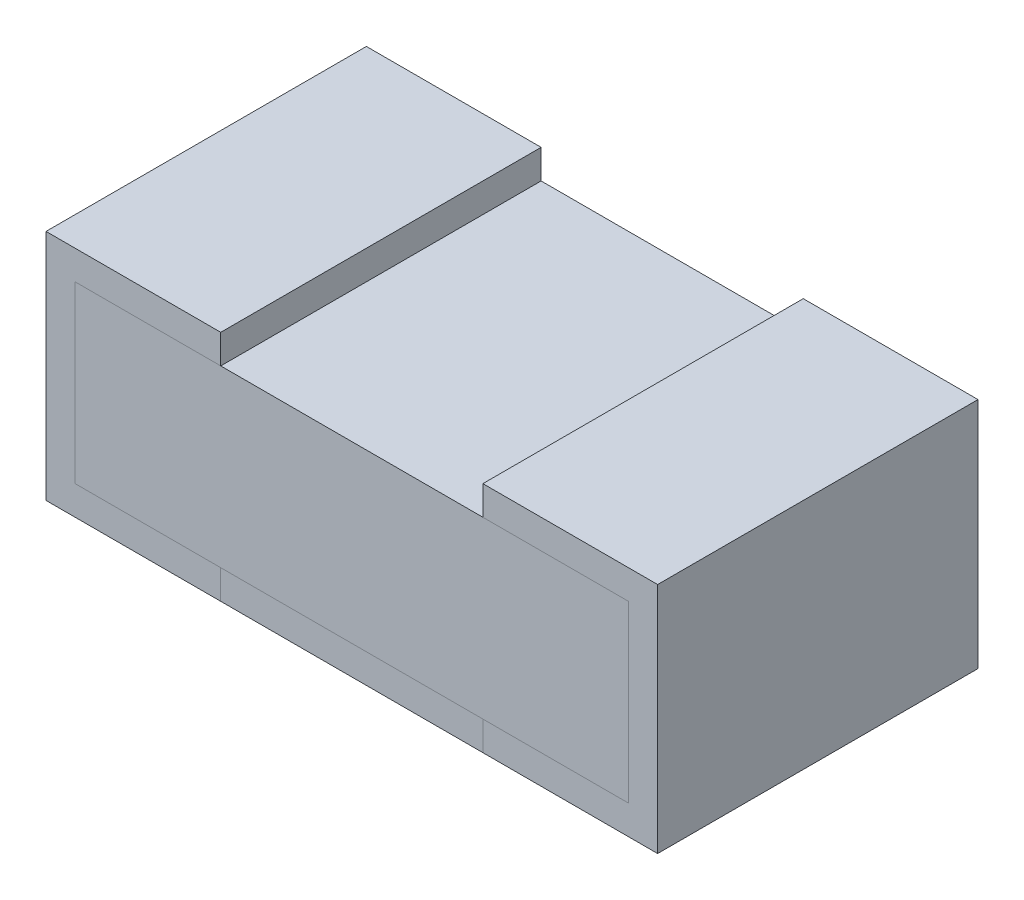
ISO-10303-21;
HEADER;
FILE_DESCRIPTION(('STEP AP214'),'2;1');
FILE_NAME('part.step','',(''),(''),'','','');
FILE_SCHEMA(('AUTOMOTIVE_DESIGN { 1 0 10303 214 1 1 1 1 }'));
ENDSEC;
DATA;
#1=APPLICATION_CONTEXT('core data for automotive mechanical design processes');
#2=APPLICATION_PROTOCOL_DEFINITION('international standard','automotive_design',2000,#1);
#3=PRODUCT_CONTEXT('',#1,'mechanical');
#4=PRODUCT('Part','Part','',(#3));
#5=PRODUCT_RELATED_PRODUCT_CATEGORY('part','',(#4));
#6=PRODUCT_DEFINITION_FORMATION('','',#4);
#7=PRODUCT_DEFINITION_CONTEXT('part definition',#1,'design');
#8=PRODUCT_DEFINITION('design','',#6,#7);
#9=PRODUCT_DEFINITION_SHAPE('','',#8);
#10=(LENGTH_UNIT() NAMED_UNIT(*) SI_UNIT(.MILLI.,.METRE.));
#11=(NAMED_UNIT(*) PLANE_ANGLE_UNIT() SI_UNIT($,.RADIAN.));
#12=(NAMED_UNIT(*) SI_UNIT($,.STERADIAN.) SOLID_ANGLE_UNIT());
#13=UNCERTAINTY_MEASURE_WITH_UNIT(LENGTH_MEASURE(1.E-05),#10,'distance_accuracy_value','');
#14=(GEOMETRIC_REPRESENTATION_CONTEXT(3) GLOBAL_UNCERTAINTY_ASSIGNED_CONTEXT((#13)) GLOBAL_UNIT_ASSIGNED_CONTEXT((#10,
#11,#12)) REPRESENTATION_CONTEXT('',''));
#15=CARTESIAN_POINT('',(0.,0.,0.));
#16=DIRECTION('',(0.,0.,1.));
#17=DIRECTION('',(1.,0.,0.));
#18=AXIS2_PLACEMENT_3D('',#15,#16,#17);
#19=CARTESIAN_POINT('',(0.749999999953739,0.,1.375));
#20=DIRECTION('',(-1.,0.,0.));
#21=DIRECTION('',(0.,0.,1.));
#22=AXIS2_PLACEMENT_3D('',#19,#20,#21);
#23=PLANE('',#22);
#24=DIRECTION('',(0.,1.,0.));
#25=VECTOR('',#24,1.);
#26=CARTESIAN_POINT('',(0.749999999953739,0.,0.));
#27=LINE('',#26,#25);
#28=CARTESIAN_POINT('',(0.749999999953739,0.,0.));
#29=VERTEX_POINT('',#28);
#30=CARTESIAN_POINT('',(0.749999999953739,0.124999999968622,0.));
#31=VERTEX_POINT('',#30);
#32=EDGE_CURVE('E143',#29,#31,#27,.T.);
#33=ORIENTED_EDGE('',*,*,#32,.T.);
#34=DIRECTION('',(0.,0.,-1.));
#35=VECTOR('',#34,1.);
#36=CARTESIAN_POINT('',(0.749999999953739,0.124999999968622,1.375));
#37=LINE('',#36,#35);
#38=CARTESIAN_POINT('',(0.749999999953739,0.124999999968622,1.375));
#39=VERTEX_POINT('',#38);
#40=EDGE_CURVE('E12',#39,#31,#37,.T.);
#41=ORIENTED_EDGE('',*,*,#40,.F.);
#42=DIRECTION('',(0.,1.,0.));
#43=VECTOR('',#42,1.);
#44=CARTESIAN_POINT('',(0.749999999953739,0.,1.375));
#45=LINE('',#44,#43);
#46=CARTESIAN_POINT('',(0.749999999953739,0.,1.375));
#47=VERTEX_POINT('',#46);
#48=EDGE_CURVE('E157',#47,#39,#45,.T.);
#49=ORIENTED_EDGE('',*,*,#48,.F.);
#50=DIRECTION('',(0.,0.,-1.));
#51=VECTOR('',#50,1.);
#52=CARTESIAN_POINT('',(0.749999999953739,0.,1.375));
#53=LINE('',#52,#51);
#54=EDGE_CURVE('E139',#47,#29,#53,.T.);
#55=ORIENTED_EDGE('',*,*,#54,.T.);
#56=EDGE_LOOP('',(#33,#41,#49,#55));
#57=FACE_BOUND('',#56,.T.);
#58=ADVANCED_FACE('F47',(#57),#23,.F.);
#59=CARTESIAN_POINT('',(0.749999999953739,0.124999999968622,1.375));
#60=DIRECTION('',(0.,-1.,0.));
#61=DIRECTION('',(0.,0.,-1.));
#62=AXIS2_PLACEMENT_3D('',#59,#60,#61);
#63=PLANE('',#62);
#64=DIRECTION('',(-1.,0.,0.));
#65=VECTOR('',#64,1.);
#66=CARTESIAN_POINT('',(0.749999999953739,0.124999999968622,0.));
#67=LINE('',#66,#65);
#68=CARTESIAN_POINT('',(0.124999999968484,0.124999999968622,0.));
#69=VERTEX_POINT('',#68);
#70=EDGE_CURVE('E146',#31,#69,#67,.T.);
#71=ORIENTED_EDGE('',*,*,#70,.T.);
#72=DIRECTION('',(0.,0.,-1.));
#73=VECTOR('',#72,1.);
#74=CARTESIAN_POINT('',(0.124999999968484,0.124999999968622,1.375));
#75=LINE('',#74,#73);
#76=CARTESIAN_POINT('',(0.124999999968484,0.124999999968622,1.375));
#77=VERTEX_POINT('',#76);
#78=EDGE_CURVE('E55',#77,#69,#75,.T.);
#79=ORIENTED_EDGE('',*,*,#78,.F.);
#80=DIRECTION('',(-1.,0.,0.));
#81=VECTOR('',#80,1.);
#82=CARTESIAN_POINT('',(0.749999999953739,0.124999999968622,1.375));
#83=LINE('',#82,#81);
#84=EDGE_CURVE('E106',#39,#77,#83,.T.);
#85=ORIENTED_EDGE('',*,*,#84,.F.);
#86=ORIENTED_EDGE('',*,*,#40,.T.);
#87=EDGE_LOOP('',(#71,#79,#85,#86));
#88=FACE_BOUND('',#87,.T.);
#89=ADVANCED_FACE('F192',(#88),#63,.F.);
#90=CARTESIAN_POINT('',(0.124999999968484,0.124999999968622,1.375));
#91=DIRECTION('',(-1.,0.,0.));
#92=DIRECTION('',(0.,0.,1.));
#93=AXIS2_PLACEMENT_3D('',#90,#91,#92);
#94=PLANE('',#93);
#95=DIRECTION('',(0.,1.,0.));
#96=VECTOR('',#95,1.);
#97=CARTESIAN_POINT('',(0.124999999968484,0.124999999968622,0.));
#98=LINE('',#97,#96);
#99=CARTESIAN_POINT('',(0.124999999968484,0.875000000098263,0.));
#100=VERTEX_POINT('',#99);
#101=EDGE_CURVE('E148',#69,#100,#98,.T.);
#102=ORIENTED_EDGE('',*,*,#101,.T.);
#103=DIRECTION('',(0.,0.,-1.));
#104=VECTOR('',#103,1.);
#105=CARTESIAN_POINT('',(0.124999999968484,0.875000000098263,1.375));
#106=LINE('',#105,#104);
#107=CARTESIAN_POINT('',(0.124999999968484,0.875000000098263,1.375));
#108=VERTEX_POINT('',#107);
#109=EDGE_CURVE('E164',#108,#100,#106,.T.);
#110=ORIENTED_EDGE('',*,*,#109,.F.);
#111=DIRECTION('',(0.,1.,0.));
#112=VECTOR('',#111,1.);
#113=CARTESIAN_POINT('',(0.124999999968484,0.124999999968622,1.375));
#114=LINE('',#113,#112);
#115=EDGE_CURVE('E172',#77,#108,#114,.T.);
#116=ORIENTED_EDGE('',*,*,#115,.F.);
#117=ORIENTED_EDGE('',*,*,#78,.T.);
#118=EDGE_LOOP('',(#102,#110,#116,#117));
#119=FACE_BOUND('',#118,.T.);
#120=ADVANCED_FACE('F170',(#119),#94,.F.);
#121=CARTESIAN_POINT('',(0.124999999968484,0.875000000098263,1.375));
#122=DIRECTION('',(0.,1.,0.));
#123=DIRECTION('',(0.,0.,1.));
#124=AXIS2_PLACEMENT_3D('',#121,#122,#123);
#125=PLANE('',#124);
#126=DIRECTION('',(1.,0.,0.));
#127=VECTOR('',#126,1.);
#128=CARTESIAN_POINT('',(0.124999999968484,0.875000000098263,0.));
#129=LINE('',#128,#127);
#130=CARTESIAN_POINT('',(0.749999999953739,0.875000000098263,0.));
#131=VERTEX_POINT('',#130);
#132=EDGE_CURVE('E150',#100,#131,#129,.T.);
#133=ORIENTED_EDGE('',*,*,#132,.T.);
#134=DIRECTION('',(0.,0.,-1.));
#135=VECTOR('',#134,1.);
#136=CARTESIAN_POINT('',(0.749999999953739,0.875000000098263,1.375));
#137=LINE('',#136,#135);
#138=CARTESIAN_POINT('',(0.749999999953739,0.875000000098263,1.375));
#139=VERTEX_POINT('',#138);
#140=EDGE_CURVE('E161',#139,#131,#137,.T.);
#141=ORIENTED_EDGE('',*,*,#140,.F.);
#142=DIRECTION('',(1.,0.,0.));
#143=VECTOR('',#142,1.);
#144=CARTESIAN_POINT('',(0.124999999968484,0.875000000098263,1.375));
#145=LINE('',#144,#143);
#146=EDGE_CURVE('E184',#108,#139,#145,.T.);
#147=ORIENTED_EDGE('',*,*,#146,.F.);
#148=ORIENTED_EDGE('',*,*,#109,.T.);
#149=EDGE_LOOP('',(#133,#141,#147,#148));
#150=FACE_BOUND('',#149,.T.);
#151=ADVANCED_FACE('F180',(#150),#125,.F.);
#152=CARTESIAN_POINT('',(0.749999999953739,0.875000000098263,1.375));
#153=DIRECTION('',(-1.,0.,0.));
#154=DIRECTION('',(0.,0.,1.));
#155=AXIS2_PLACEMENT_3D('',#152,#153,#154);
#156=PLANE('',#155);
#157=DIRECTION('',(0.,1.,0.));
#158=VECTOR('',#157,1.);
#159=CARTESIAN_POINT('',(0.749999999953739,0.875000000098263,0.));
#160=LINE('',#159,#158);
#161=CARTESIAN_POINT('',(0.749999999953739,1.0000000000332,0.));
#162=VERTEX_POINT('',#161);
#163=EDGE_CURVE('E152',#131,#162,#160,.T.);
#164=ORIENTED_EDGE('',*,*,#163,.T.);
#165=DIRECTION('',(0.,0.,-1.));
#166=VECTOR('',#165,1.);
#167=CARTESIAN_POINT('',(0.749999999953739,1.0000000000332,1.375));
#168=LINE('',#167,#166);
#169=CARTESIAN_POINT('',(0.749999999953739,1.0000000000332,1.375));
#170=VERTEX_POINT('',#169);
#171=EDGE_CURVE('E134',#170,#162,#168,.T.);
#172=ORIENTED_EDGE('',*,*,#171,.F.);
#173=DIRECTION('',(0.,1.,0.));
#174=VECTOR('',#173,1.);
#175=CARTESIAN_POINT('',(0.749999999953739,0.875000000098263,1.375));
#176=LINE('',#175,#174);
#177=EDGE_CURVE('E125',#139,#170,#176,.T.);
#178=ORIENTED_EDGE('',*,*,#177,.F.);
#179=ORIENTED_EDGE('',*,*,#140,.T.);
#180=EDGE_LOOP('',(#164,#172,#178,#179));
#181=FACE_BOUND('',#180,.T.);
#182=ADVANCED_FACE('F183',(#181),#156,.F.);
#183=CARTESIAN_POINT('',(0.749999999953739,1.0000000000332,1.375));
#184=DIRECTION('',(0.,-1.,0.));
#185=DIRECTION('',(0.,0.,-1.));
#186=AXIS2_PLACEMENT_3D('',#183,#184,#185);
#187=PLANE('',#186);
#188=DIRECTION('',(-1.,0.,0.));
#189=VECTOR('',#188,1.);
#190=CARTESIAN_POINT('',(0.749999999953739,1.0000000000332,0.));
#191=LINE('',#190,#189);
#192=CARTESIAN_POINT('',(0.,1.0000000000332,0.));
#193=VERTEX_POINT('',#192);
#194=EDGE_CURVE('E133',#162,#193,#191,.T.);
#195=ORIENTED_EDGE('',*,*,#194,.T.);
#196=DIRECTION('',(0.,0.,-1.));
#197=VECTOR('',#196,1.);
#198=CARTESIAN_POINT('',(0.,1.0000000000332,1.375));
#199=LINE('',#198,#197);
#200=CARTESIAN_POINT('',(0.,1.0000000000332,1.375));
#201=VERTEX_POINT('',#200);
#202=EDGE_CURVE('E130',#201,#193,#199,.T.);
#203=ORIENTED_EDGE('',*,*,#202,.F.);
#204=DIRECTION('',(-1.,0.,0.));
#205=VECTOR('',#204,1.);
#206=CARTESIAN_POINT('',(0.749999999953739,1.0000000000332,1.375));
#207=LINE('',#206,#205);
#208=EDGE_CURVE('E119',#170,#201,#207,.T.);
#209=ORIENTED_EDGE('',*,*,#208,.F.);
#210=ORIENTED_EDGE('',*,*,#171,.T.);
#211=EDGE_LOOP('',(#195,#203,#209,#210));
#212=FACE_BOUND('',#211,.T.);
#213=ADVANCED_FACE('F131',(#212),#187,.F.);
#214=CARTESIAN_POINT('',(0.,1.0000000000332,1.375));
#215=DIRECTION('',(1.,0.,0.));
#216=DIRECTION('',(0.,0.,-1.));
#217=AXIS2_PLACEMENT_3D('',#214,#215,#216);
#218=PLANE('',#217);
#219=DIRECTION('',(0.,-1.,0.));
#220=VECTOR('',#219,1.);
#221=CARTESIAN_POINT('',(0.,1.0000000000332,0.));
#222=LINE('',#221,#220);
#223=CARTESIAN_POINT('',(0.,0.,0.));
#224=VERTEX_POINT('',#223);
#225=EDGE_CURVE('E92',#193,#224,#222,.T.);
#226=ORIENTED_EDGE('',*,*,#225,.T.);
#227=DIRECTION('',(0.,0.,-1.));
#228=VECTOR('',#227,1.);
#229=CARTESIAN_POINT('',(0.,0.,1.375));
#230=LINE('',#229,#228);
#231=CARTESIAN_POINT('',(0.,0.,1.375));
#232=VERTEX_POINT('',#231);
#233=EDGE_CURVE('E135',#232,#224,#230,.T.);
#234=ORIENTED_EDGE('',*,*,#233,.F.);
#235=DIRECTION('',(0.,-1.,0.));
#236=VECTOR('',#235,1.);
#237=CARTESIAN_POINT('',(0.,1.0000000000332,1.375));
#238=LINE('',#237,#236);
#239=EDGE_CURVE('E123',#201,#232,#238,.T.);
#240=ORIENTED_EDGE('',*,*,#239,.F.);
#241=ORIENTED_EDGE('',*,*,#202,.T.);
#242=EDGE_LOOP('',(#226,#234,#240,#241));
#243=FACE_BOUND('',#242,.T.);
#244=ADVANCED_FACE('F137',(#243),#218,.F.);
#245=CARTESIAN_POINT('',(0.,0.,1.375));
#246=DIRECTION('',(0.,1.,0.));
#247=DIRECTION('',(0.,0.,1.));
#248=AXIS2_PLACEMENT_3D('',#245,#246,#247);
#249=PLANE('',#248);
#250=DIRECTION('',(1.,0.,0.));
#251=VECTOR('',#250,1.);
#252=CARTESIAN_POINT('',(0.,0.,0.));
#253=LINE('',#252,#251);
#254=EDGE_CURVE('E98',#224,#29,#253,.T.);
#255=ORIENTED_EDGE('',*,*,#254,.T.);
#256=ORIENTED_EDGE('',*,*,#54,.F.);
#257=DIRECTION('',(1.,0.,0.));
#258=VECTOR('',#257,1.);
#259=CARTESIAN_POINT('',(0.,0.,1.375));
#260=LINE('',#259,#258);
#261=EDGE_CURVE('E63',#232,#47,#260,.T.);
#262=ORIENTED_EDGE('',*,*,#261,.F.);
#263=ORIENTED_EDGE('',*,*,#233,.T.);
#264=EDGE_LOOP('',(#255,#256,#262,#263));
#265=FACE_BOUND('',#264,.T.);
#266=ADVANCED_FACE('F208',(#265),#249,.F.);
#267=CARTESIAN_POINT('',(0.,0.,1.375));
#268=DIRECTION('',(0.,0.,1.));
#269=DIRECTION('',(1.,0.,0.));
#270=AXIS2_PLACEMENT_3D('',#267,#268,#269);
#271=PLANE('',#270);
#272=ORIENTED_EDGE('',*,*,#48,.T.);
#273=ORIENTED_EDGE('',*,*,#84,.T.);
#274=ORIENTED_EDGE('',*,*,#115,.T.);
#275=ORIENTED_EDGE('',*,*,#146,.T.);
#276=ORIENTED_EDGE('',*,*,#177,.T.);
#277=ORIENTED_EDGE('',*,*,#208,.T.);
#278=ORIENTED_EDGE('',*,*,#239,.T.);
#279=ORIENTED_EDGE('',*,*,#261,.T.);
#280=EDGE_LOOP('',(#272,#273,#274,#275,#276,#277,#278,#279));
#281=FACE_BOUND('',#280,.T.);
#282=ADVANCED_FACE('F121',(#281),#271,.T.);
#283=CARTESIAN_POINT('',(0.,0.,0.));
#284=DIRECTION('',(0.,0.,1.));
#285=DIRECTION('',(1.,0.,0.));
#286=AXIS2_PLACEMENT_3D('',#283,#284,#285);
#287=PLANE('',#286);
#288=ORIENTED_EDGE('',*,*,#32,.F.);
#289=ORIENTED_EDGE('',*,*,#254,.F.);
#290=ORIENTED_EDGE('',*,*,#225,.F.);
#291=ORIENTED_EDGE('',*,*,#194,.F.);
#292=ORIENTED_EDGE('',*,*,#163,.F.);
#293=ORIENTED_EDGE('',*,*,#132,.F.);
#294=ORIENTED_EDGE('',*,*,#101,.F.);
#295=ORIENTED_EDGE('',*,*,#70,.F.);
#296=EDGE_LOOP('',(#288,#289,#290,#291,#292,#293,#294,#295));
#297=FACE_BOUND('',#296,.T.);
#298=ADVANCED_FACE('F176',(#297),#287,.F.);
#299=CLOSED_SHELL('',(#58,#89,#120,#151,#182,#213,#244,#266,#282,#298));
#300=MANIFOLD_SOLID_BREP('B2',#299);
#301=CARTESIAN_POINT('',(1.87499999995575,0.124999999968622,0.));
#302=DIRECTION('',(1.,0.,0.));
#303=DIRECTION('',(0.,0.,-1.));
#304=AXIS2_PLACEMENT_3D('',#301,#302,#303);
#305=PLANE('',#304);
#306=DIRECTION('',(0.,1.,0.));
#307=VECTOR('',#306,1.);
#308=CARTESIAN_POINT('',(1.87499999995575,0.124999999968622,1.375));
#309=LINE('',#308,#307);
#310=CARTESIAN_POINT('',(1.87499999995575,0.,1.375));
#311=VERTEX_POINT('',#310);
#312=CARTESIAN_POINT('',(1.87499999995575,0.124999999968622,1.375));
#313=VERTEX_POINT('',#312);
#314=EDGE_CURVE('E348',#311,#313,#309,.T.);
#315=ORIENTED_EDGE('',*,*,#314,.F.);
#316=DIRECTION('',(0.,0.,1.));
#317=VECTOR('',#316,1.);
#318=CARTESIAN_POINT('',(1.87499999995575,0.,0.));
#319=LINE('',#318,#317);
#320=CARTESIAN_POINT('',(1.87499999995575,0.,0.));
#321=VERTEX_POINT('',#320);
#322=EDGE_CURVE('E45',#321,#311,#319,.T.);
#323=ORIENTED_EDGE('',*,*,#322,.F.);
#324=DIRECTION('',(0.,1.,0.));
#325=VECTOR('',#324,1.);
#326=CARTESIAN_POINT('',(1.87499999995575,0.124999999968622,0.));
#327=LINE('',#326,#325);
#328=CARTESIAN_POINT('',(1.87499999995575,0.124999999968622,0.));
#329=VERTEX_POINT('',#328);
#330=EDGE_CURVE('E342',#321,#329,#327,.T.);
#331=ORIENTED_EDGE('',*,*,#330,.T.);
#332=DIRECTION('',(0.,0.,1.));
#333=VECTOR('',#332,1.);
#334=CARTESIAN_POINT('',(1.87499999995575,0.124999999968622,0.));
#335=LINE('',#334,#333);
#336=EDGE_CURVE('E287',#329,#313,#335,.T.);
#337=ORIENTED_EDGE('',*,*,#336,.T.);
#338=EDGE_LOOP('',(#315,#323,#331,#337));
#339=FACE_BOUND('',#338,.T.);
#340=ADVANCED_FACE('F284',(#339),#305,.T.);
#341=CARTESIAN_POINT('',(1.87499999995575,0.,0.));
#342=DIRECTION('',(0.,-1.,0.));
#343=DIRECTION('',(0.,0.,-1.));
#344=AXIS2_PLACEMENT_3D('',#341,#342,#343);
#345=PLANE('',#344);
#346=DIRECTION('',(1.,0.,0.));
#347=VECTOR('',#346,1.);
#348=CARTESIAN_POINT('',(1.87499999995575,0.,1.375));
#349=LINE('',#348,#347);
#350=CARTESIAN_POINT('',(0.749999999953739,0.,1.375));
#351=VERTEX_POINT('',#350);
#352=EDGE_CURVE('E344',#351,#311,#349,.T.);
#353=ORIENTED_EDGE('',*,*,#352,.F.);
#354=DIRECTION('',(0.,0.,1.));
#355=VECTOR('',#354,1.);
#356=CARTESIAN_POINT('',(0.749999999953739,0.,0.));
#357=LINE('',#356,#355);
#358=CARTESIAN_POINT('',(0.749999999953739,0.,0.));
#359=VERTEX_POINT('',#358);
#360=EDGE_CURVE('E293',#359,#351,#357,.T.);
#361=ORIENTED_EDGE('',*,*,#360,.F.);
#362=DIRECTION('',(1.,0.,0.));
#363=VECTOR('',#362,1.);
#364=CARTESIAN_POINT('',(1.87499999995575,0.,0.));
#365=LINE('',#364,#363);
#366=EDGE_CURVE('E339',#359,#321,#365,.T.);
#367=ORIENTED_EDGE('',*,*,#366,.T.);
#368=ORIENTED_EDGE('',*,*,#322,.T.);
#369=EDGE_LOOP('',(#353,#361,#367,#368));
#370=FACE_BOUND('',#369,.T.);
#371=ADVANCED_FACE('F358',(#370),#345,.T.);
#372=CARTESIAN_POINT('',(0.749999999953739,0.,0.));
#373=DIRECTION('',(-1.,0.,0.));
#374=DIRECTION('',(0.,0.,1.));
#375=AXIS2_PLACEMENT_3D('',#372,#373,#374);
#376=PLANE('',#375);
#377=DIRECTION('',(0.,-1.,0.));
#378=VECTOR('',#377,1.);
#379=CARTESIAN_POINT('',(0.749999999953739,0.,1.375));
#380=LINE('',#379,#378);
#381=CARTESIAN_POINT('',(0.749999999953739,0.124999999968622,1.375));
#382=VERTEX_POINT('',#381);
#383=EDGE_CURVE('E334',#382,#351,#380,.T.);
#384=ORIENTED_EDGE('',*,*,#383,.F.);
#385=DIRECTION('',(0.,0.,1.));
#386=VECTOR('',#385,1.);
#387=CARTESIAN_POINT('',(0.749999999953739,0.124999999968622,0.));
#388=LINE('',#387,#386);
#389=CARTESIAN_POINT('',(0.749999999953739,0.124999999968622,0.));
#390=VERTEX_POINT('',#389);
#391=EDGE_CURVE('E329',#390,#382,#388,.T.);
#392=ORIENTED_EDGE('',*,*,#391,.F.);
#393=DIRECTION('',(0.,-1.,0.));
#394=VECTOR('',#393,1.);
#395=CARTESIAN_POINT('',(0.749999999953739,0.,0.));
#396=LINE('',#395,#394);
#397=EDGE_CURVE('E332',#390,#359,#396,.T.);
#398=ORIENTED_EDGE('',*,*,#397,.T.);
#399=ORIENTED_EDGE('',*,*,#360,.T.);
#400=EDGE_LOOP('',(#384,#392,#398,#399));
#401=FACE_BOUND('',#400,.T.);
#402=ADVANCED_FACE('F331',(#401),#376,.T.);
#403=CARTESIAN_POINT('',(0.749999999953739,0.124999999968622,0.));
#404=DIRECTION('',(0.,1.,0.));
#405=DIRECTION('',(0.,0.,1.));
#406=AXIS2_PLACEMENT_3D('',#403,#404,#405);
#407=PLANE('',#406);
#408=DIRECTION('',(-1.,0.,0.));
#409=VECTOR('',#408,1.);
#410=CARTESIAN_POINT('',(0.749999999953739,0.124999999968622,1.375));
#411=LINE('',#410,#409);
#412=EDGE_CURVE('E351',#313,#382,#411,.T.);
#413=ORIENTED_EDGE('',*,*,#412,.F.);
#414=ORIENTED_EDGE('',*,*,#336,.F.);
#415=DIRECTION('',(-1.,0.,0.));
#416=VECTOR('',#415,1.);
#417=CARTESIAN_POINT('',(0.749999999953739,0.124999999968622,0.));
#418=LINE('',#417,#416);
#419=EDGE_CURVE('E338',#329,#390,#418,.T.);
#420=ORIENTED_EDGE('',*,*,#419,.T.);
#421=ORIENTED_EDGE('',*,*,#391,.T.);
#422=EDGE_LOOP('',(#413,#414,#420,#421));
#423=FACE_BOUND('',#422,.T.);
#424=ADVANCED_FACE('F341',(#423),#407,.T.);
#425=CARTESIAN_POINT('',(0.,0.,0.));
#426=DIRECTION('',(0.,0.,-1.));
#427=DIRECTION('',(-1.,0.,0.));
#428=AXIS2_PLACEMENT_3D('',#425,#426,#427);
#429=PLANE('',#428);
#430=ORIENTED_EDGE('',*,*,#330,.F.);
#431=ORIENTED_EDGE('',*,*,#366,.F.);
#432=ORIENTED_EDGE('',*,*,#397,.F.);
#433=ORIENTED_EDGE('',*,*,#419,.F.);
#434=EDGE_LOOP('',(#430,#431,#432,#433));
#435=FACE_BOUND('',#434,.T.);
#436=ADVANCED_FACE('F337',(#435),#429,.T.);
#437=CARTESIAN_POINT('',(0.,0.,1.375));
#438=DIRECTION('',(0.,0.,-1.));
#439=DIRECTION('',(-1.,0.,0.));
#440=AXIS2_PLACEMENT_3D('',#437,#438,#439);
#441=PLANE('',#440);
#442=ORIENTED_EDGE('',*,*,#314,.T.);
#443=ORIENTED_EDGE('',*,*,#412,.T.);
#444=ORIENTED_EDGE('',*,*,#383,.T.);
#445=ORIENTED_EDGE('',*,*,#352,.T.);
#446=EDGE_LOOP('',(#442,#443,#444,#445));
#447=FACE_BOUND('',#446,.T.);
#448=ADVANCED_FACE('F357',(#447),#441,.F.);
#449=CLOSED_SHELL('',(#340,#371,#402,#424,#436,#448));
#450=MANIFOLD_SOLID_BREP('B6',#449);
#451=CARTESIAN_POINT('',(2.49999999994099,0.875000000131951,0.));
#452=DIRECTION('',(1.,0.,0.));
#453=DIRECTION('',(0.,0.,-1.));
#454=AXIS2_PLACEMENT_3D('',#451,#452,#453);
#455=PLANE('',#454);
#456=DIRECTION('',(0.,1.,0.));
#457=VECTOR('',#456,1.);
#458=CARTESIAN_POINT('',(2.49999999994099,0.875000000131951,1.375));
#459=LINE('',#458,#457);
#460=CARTESIAN_POINT('',(2.49999999994099,0.124999999968622,1.375));
#461=VERTEX_POINT('',#460);
#462=CARTESIAN_POINT('',(2.49999999994099,0.875000000131951,1.375));
#463=VERTEX_POINT('',#462);
#464=EDGE_CURVE('E480',#461,#463,#459,.T.);
#465=ORIENTED_EDGE('',*,*,#464,.F.);
#466=DIRECTION('',(0.,0.,1.));
#467=VECTOR('',#466,1.);
#468=CARTESIAN_POINT('',(2.49999999994099,0.124999999968622,0.));
#469=LINE('',#468,#467);
#470=CARTESIAN_POINT('',(2.49999999994099,0.124999999968622,0.));
#471=VERTEX_POINT('',#470);
#472=EDGE_CURVE('E282',#471,#461,#469,.T.);
#473=ORIENTED_EDGE('',*,*,#472,.F.);
#474=DIRECTION('',(0.,1.,0.));
#475=VECTOR('',#474,1.);
#476=CARTESIAN_POINT('',(2.49999999994099,0.875000000131951,0.));
#477=LINE('',#476,#475);
#478=CARTESIAN_POINT('',(2.49999999994099,0.875000000131951,0.));
#479=VERTEX_POINT('',#478);
#480=EDGE_CURVE('E474',#471,#479,#477,.T.);
#481=ORIENTED_EDGE('',*,*,#480,.T.);
#482=DIRECTION('',(0.,0.,1.));
#483=VECTOR('',#482,1.);
#484=CARTESIAN_POINT('',(2.49999999994099,0.875000000131951,0.));
#485=LINE('',#484,#483);
#486=EDGE_CURVE('E419',#479,#463,#485,.T.);
#487=ORIENTED_EDGE('',*,*,#486,.T.);
#488=EDGE_LOOP('',(#465,#473,#481,#487));
#489=FACE_BOUND('',#488,.T.);
#490=ADVANCED_FACE('F416',(#489),#455,.T.);
#491=CARTESIAN_POINT('',(2.49999999994099,0.124999999968622,0.));
#492=DIRECTION('',(0.,-1.,0.));
#493=DIRECTION('',(0.,0.,-1.));
#494=AXIS2_PLACEMENT_3D('',#491,#492,#493);
#495=PLANE('',#494);
#496=DIRECTION('',(1.,0.,0.));
#497=VECTOR('',#496,1.);
#498=CARTESIAN_POINT('',(2.49999999994099,0.124999999968622,1.375));
#499=LINE('',#498,#497);
#500=CARTESIAN_POINT('',(0.124999999968484,0.124999999968622,1.375));
#501=VERTEX_POINT('',#500);
#502=EDGE_CURVE('E476',#501,#461,#499,.T.);
#503=ORIENTED_EDGE('',*,*,#502,.F.);
#504=DIRECTION('',(0.,0.,1.));
#505=VECTOR('',#504,1.);
#506=CARTESIAN_POINT('',(0.124999999968484,0.124999999968622,0.));
#507=LINE('',#506,#505);
#508=CARTESIAN_POINT('',(0.124999999968484,0.124999999968622,0.));
#509=VERTEX_POINT('',#508);
#510=EDGE_CURVE('E425',#509,#501,#507,.T.);
#511=ORIENTED_EDGE('',*,*,#510,.F.);
#512=DIRECTION('',(1.,0.,0.));
#513=VECTOR('',#512,1.);
#514=CARTESIAN_POINT('',(2.49999999994099,0.124999999968622,0.));
#515=LINE('',#514,#513);
#516=EDGE_CURVE('E471',#509,#471,#515,.T.);
#517=ORIENTED_EDGE('',*,*,#516,.T.);
#518=ORIENTED_EDGE('',*,*,#472,.T.);
#519=EDGE_LOOP('',(#503,#511,#517,#518));
#520=FACE_BOUND('',#519,.T.);
#521=ADVANCED_FACE('F490',(#520),#495,.T.);
#522=CARTESIAN_POINT('',(0.124999999968484,0.124999999968622,0.));
#523=DIRECTION('',(-1.,0.,0.));
#524=DIRECTION('',(0.,0.,1.));
#525=AXIS2_PLACEMENT_3D('',#522,#523,#524);
#526=PLANE('',#525);
#527=DIRECTION('',(0.,-1.,0.));
#528=VECTOR('',#527,1.);
#529=CARTESIAN_POINT('',(0.124999999968484,0.124999999968622,1.375));
#530=LINE('',#529,#528);
#531=CARTESIAN_POINT('',(0.124999999968484,0.875000000098263,1.375));
#532=VERTEX_POINT('',#531);
#533=EDGE_CURVE('E466',#532,#501,#530,.T.);
#534=ORIENTED_EDGE('',*,*,#533,.F.);
#535=DIRECTION('',(0.,0.,1.));
#536=VECTOR('',#535,1.);
#537=CARTESIAN_POINT('',(0.124999999968484,0.875000000098263,0.));
#538=LINE('',#537,#536);
#539=CARTESIAN_POINT('',(0.124999999968484,0.875000000098263,0.));
#540=VERTEX_POINT('',#539);
#541=EDGE_CURVE('E461',#540,#532,#538,.T.);
#542=ORIENTED_EDGE('',*,*,#541,.F.);
#543=DIRECTION('',(0.,-1.,0.));
#544=VECTOR('',#543,1.);
#545=CARTESIAN_POINT('',(0.124999999968484,0.124999999968622,0.));
#546=LINE('',#545,#544);
#547=EDGE_CURVE('E464',#540,#509,#546,.T.);
#548=ORIENTED_EDGE('',*,*,#547,.T.);
#549=ORIENTED_EDGE('',*,*,#510,.T.);
#550=EDGE_LOOP('',(#534,#542,#548,#549));
#551=FACE_BOUND('',#550,.T.);
#552=ADVANCED_FACE('F463',(#551),#526,.T.);
#553=CARTESIAN_POINT('',(0.124999999968484,0.875000000098263,0.));
#554=DIRECTION('',(-1.41845599595198E-11,1.,0.));
#555=DIRECTION('',(-1.,-1.41845599595198E-11,0.));
#556=AXIS2_PLACEMENT_3D('',#553,#554,#555);
#557=PLANE('',#556);
#558=DIRECTION('',(-1.,-1.41845599595198E-11,0.));
#559=VECTOR('',#558,1.);
#560=CARTESIAN_POINT('',(0.124999999968484,0.875000000098263,1.375));
#561=LINE('',#560,#559);
#562=EDGE_CURVE('E483',#463,#532,#561,.T.);
#563=ORIENTED_EDGE('',*,*,#562,.F.);
#564=ORIENTED_EDGE('',*,*,#486,.F.);
#565=DIRECTION('',(-1.,-1.41845599595198E-11,0.));
#566=VECTOR('',#565,1.);
#567=CARTESIAN_POINT('',(0.124999999968484,0.875000000098263,0.));
#568=LINE('',#567,#566);
#569=EDGE_CURVE('E470',#479,#540,#568,.T.);
#570=ORIENTED_EDGE('',*,*,#569,.T.);
#571=ORIENTED_EDGE('',*,*,#541,.T.);
#572=EDGE_LOOP('',(#563,#564,#570,#571));
#573=FACE_BOUND('',#572,.T.);
#574=ADVANCED_FACE('F473',(#573),#557,.T.);
#575=CARTESIAN_POINT('',(0.,0.,0.));
#576=DIRECTION('',(0.,0.,-1.));
#577=DIRECTION('',(-1.,0.,0.));
#578=AXIS2_PLACEMENT_3D('',#575,#576,#577);
#579=PLANE('',#578);
#580=ORIENTED_EDGE('',*,*,#480,.F.);
#581=ORIENTED_EDGE('',*,*,#516,.F.);
#582=ORIENTED_EDGE('',*,*,#547,.F.);
#583=ORIENTED_EDGE('',*,*,#569,.F.);
#584=EDGE_LOOP('',(#580,#581,#582,#583));
#585=FACE_BOUND('',#584,.T.);
#586=ADVANCED_FACE('F469',(#585),#579,.T.);
#587=CARTESIAN_POINT('',(0.,0.,1.375));
#588=DIRECTION('',(0.,0.,-1.));
#589=DIRECTION('',(-1.,0.,0.));
#590=AXIS2_PLACEMENT_3D('',#587,#588,#589);
#591=PLANE('',#590);
#592=ORIENTED_EDGE('',*,*,#464,.T.);
#593=ORIENTED_EDGE('',*,*,#562,.T.);
#594=ORIENTED_EDGE('',*,*,#533,.T.);
#595=ORIENTED_EDGE('',*,*,#502,.T.);
#596=EDGE_LOOP('',(#592,#593,#594,#595));
#597=FACE_BOUND('',#596,.T.);
#598=ADVANCED_FACE('F489',(#597),#591,.F.);
#599=CLOSED_SHELL('',(#490,#521,#552,#574,#586,#598));
#600=MANIFOLD_SOLID_BREP('B39',#599);
#601=CARTESIAN_POINT('',(1.87499999995575,1.00000000010057,1.375));
#602=DIRECTION('',(1.,0.,0.));
#603=DIRECTION('',(0.,0.,-1.));
#604=AXIS2_PLACEMENT_3D('',#601,#602,#603);
#605=PLANE('',#604);
#606=DIRECTION('',(0.,-1.,0.));
#607=VECTOR('',#606,1.);
#608=CARTESIAN_POINT('',(1.87499999995575,1.00000000010057,0.));
#609=LINE('',#608,#607);
#610=CARTESIAN_POINT('',(1.87499999995575,1.00000000010057,0.));
#611=VERTEX_POINT('',#610);
#612=CARTESIAN_POINT('',(1.87499999995575,0.875000000131951,0.));
#613=VERTEX_POINT('',#612);
#614=EDGE_CURVE('E635',#611,#613,#609,.T.);
#615=ORIENTED_EDGE('',*,*,#614,.T.);
#616=DIRECTION('',(0.,0.,-1.));
#617=VECTOR('',#616,1.);
#618=CARTESIAN_POINT('',(1.87499999995575,0.875000000131951,1.375));
#619=LINE('',#618,#617);
#620=CARTESIAN_POINT('',(1.87499999995575,0.875000000131951,1.375));
#621=VERTEX_POINT('',#620);
#622=EDGE_CURVE('E414',#621,#613,#619,.T.);
#623=ORIENTED_EDGE('',*,*,#622,.F.);
#624=DIRECTION('',(0.,-1.,0.));
#625=VECTOR('',#624,1.);
#626=CARTESIAN_POINT('',(1.87499999995575,1.00000000010057,1.375));
#627=LINE('',#626,#625);
#628=CARTESIAN_POINT('',(1.87499999995575,1.00000000010057,1.375));
#629=VERTEX_POINT('',#628);
#630=EDGE_CURVE('E649',#629,#621,#627,.T.);
#631=ORIENTED_EDGE('',*,*,#630,.F.);
#632=DIRECTION('',(0.,0.,-1.));
#633=VECTOR('',#632,1.);
#634=CARTESIAN_POINT('',(1.87499999995575,1.00000000010057,1.375));
#635=LINE('',#634,#633);
#636=EDGE_CURVE('E631',#629,#611,#635,.T.);
#637=ORIENTED_EDGE('',*,*,#636,.T.);
#638=EDGE_LOOP('',(#615,#623,#631,#637));
#639=FACE_BOUND('',#638,.T.);
#640=ADVANCED_FACE('F539',(#639),#605,.F.);
#641=CARTESIAN_POINT('',(1.87499999995575,0.875000000131951,1.375));
#642=DIRECTION('',(0.,1.,0.));
#643=DIRECTION('',(0.,0.,1.));
#644=AXIS2_PLACEMENT_3D('',#641,#642,#643);
#645=PLANE('',#644);
#646=DIRECTION('',(1.,0.,0.));
#647=VECTOR('',#646,1.);
#648=CARTESIAN_POINT('',(1.87499999995575,0.875000000131951,0.));
#649=LINE('',#648,#647);
#650=CARTESIAN_POINT('',(2.49999999994099,0.875000000131951,0.));
#651=VERTEX_POINT('',#650);
#652=EDGE_CURVE('E638',#613,#651,#649,.T.);
#653=ORIENTED_EDGE('',*,*,#652,.T.);
#654=DIRECTION('',(0.,0.,-1.));
#655=VECTOR('',#654,1.);
#656=CARTESIAN_POINT('',(2.49999999994099,0.875000000131951,1.375));
#657=LINE('',#656,#655);
#658=CARTESIAN_POINT('',(2.49999999994099,0.875000000131951,1.375));
#659=VERTEX_POINT('',#658);
#660=EDGE_CURVE('E547',#659,#651,#657,.T.);
#661=ORIENTED_EDGE('',*,*,#660,.F.);
#662=DIRECTION('',(1.,0.,0.));
#663=VECTOR('',#662,1.);
#664=CARTESIAN_POINT('',(1.87499999995575,0.875000000131951,1.375));
#665=LINE('',#664,#663);
#666=EDGE_CURVE('E598',#621,#659,#665,.T.);
#667=ORIENTED_EDGE('',*,*,#666,.F.);
#668=ORIENTED_EDGE('',*,*,#622,.T.);
#669=EDGE_LOOP('',(#653,#661,#667,#668));
#670=FACE_BOUND('',#669,.T.);
#671=ADVANCED_FACE('F684',(#670),#645,.F.);
#672=CARTESIAN_POINT('',(2.49999999994099,0.875000000131951,1.375));
#673=DIRECTION('',(1.,0.,0.));
#674=DIRECTION('',(0.,0.,-1.));
#675=AXIS2_PLACEMENT_3D('',#672,#673,#674);
#676=PLANE('',#675);
#677=DIRECTION('',(0.,-1.,0.));
#678=VECTOR('',#677,1.);
#679=CARTESIAN_POINT('',(2.49999999994099,0.875000000131951,0.));
#680=LINE('',#679,#678);
#681=CARTESIAN_POINT('',(2.49999999994099,0.124999999968622,0.));
#682=VERTEX_POINT('',#681);
#683=EDGE_CURVE('E640',#651,#682,#680,.T.);
#684=ORIENTED_EDGE('',*,*,#683,.T.);
#685=DIRECTION('',(0.,0.,-1.));
#686=VECTOR('',#685,1.);
#687=CARTESIAN_POINT('',(2.49999999994099,0.124999999968622,1.375));
#688=LINE('',#687,#686);
#689=CARTESIAN_POINT('',(2.49999999994099,0.124999999968622,1.375));
#690=VERTEX_POINT('',#689);
#691=EDGE_CURVE('E656',#690,#682,#688,.T.);
#692=ORIENTED_EDGE('',*,*,#691,.F.);
#693=DIRECTION('',(0.,-1.,0.));
#694=VECTOR('',#693,1.);
#695=CARTESIAN_POINT('',(2.49999999994099,0.875000000131951,1.375));
#696=LINE('',#695,#694);
#697=EDGE_CURVE('E664',#659,#690,#696,.T.);
#698=ORIENTED_EDGE('',*,*,#697,.F.);
#699=ORIENTED_EDGE('',*,*,#660,.T.);
#700=EDGE_LOOP('',(#684,#692,#698,#699));
#701=FACE_BOUND('',#700,.T.);
#702=ADVANCED_FACE('F662',(#701),#676,.F.);
#703=CARTESIAN_POINT('',(2.49999999994099,0.124999999968622,1.375));
#704=DIRECTION('',(0.,-1.,0.));
#705=DIRECTION('',(0.,0.,-1.));
#706=AXIS2_PLACEMENT_3D('',#703,#704,#705);
#707=PLANE('',#706);
#708=DIRECTION('',(-1.,0.,0.));
#709=VECTOR('',#708,1.);
#710=CARTESIAN_POINT('',(2.49999999994099,0.124999999968622,0.));
#711=LINE('',#710,#709);
#712=CARTESIAN_POINT('',(1.87499999995575,0.124999999968622,0.));
#713=VERTEX_POINT('',#712);
#714=EDGE_CURVE('E642',#682,#713,#711,.T.);
#715=ORIENTED_EDGE('',*,*,#714,.T.);
#716=DIRECTION('',(0.,0.,-1.));
#717=VECTOR('',#716,1.);
#718=CARTESIAN_POINT('',(1.87499999995575,0.124999999968622,1.375));
#719=LINE('',#718,#717);
#720=CARTESIAN_POINT('',(1.87499999995575,0.124999999968622,1.375));
#721=VERTEX_POINT('',#720);
#722=EDGE_CURVE('E653',#721,#713,#719,.T.);
#723=ORIENTED_EDGE('',*,*,#722,.F.);
#724=DIRECTION('',(-1.,0.,0.));
#725=VECTOR('',#724,1.);
#726=CARTESIAN_POINT('',(2.49999999994099,0.124999999968622,1.375));
#727=LINE('',#726,#725);
#728=EDGE_CURVE('E676',#690,#721,#727,.T.);
#729=ORIENTED_EDGE('',*,*,#728,.F.);
#730=ORIENTED_EDGE('',*,*,#691,.T.);
#731=EDGE_LOOP('',(#715,#723,#729,#730));
#732=FACE_BOUND('',#731,.T.);
#733=ADVANCED_FACE('F672',(#732),#707,.F.);
#734=CARTESIAN_POINT('',(1.87499999995575,0.124999999968622,1.375));
#735=DIRECTION('',(1.,0.,0.));
#736=DIRECTION('',(0.,0.,-1.));
#737=AXIS2_PLACEMENT_3D('',#734,#735,#736);
#738=PLANE('',#737);
#739=DIRECTION('',(0.,-1.,0.));
#740=VECTOR('',#739,1.);
#741=CARTESIAN_POINT('',(1.87499999995575,0.124999999968622,0.));
#742=LINE('',#741,#740);
#743=CARTESIAN_POINT('',(1.87499999995575,0.,0.));
#744=VERTEX_POINT('',#743);
#745=EDGE_CURVE('E644',#713,#744,#742,.T.);
#746=ORIENTED_EDGE('',*,*,#745,.T.);
#747=DIRECTION('',(0.,0.,-1.));
#748=VECTOR('',#747,1.);
#749=CARTESIAN_POINT('',(1.87499999995575,0.,1.375));
#750=LINE('',#749,#748);
#751=CARTESIAN_POINT('',(1.87499999995575,0.,1.375));
#752=VERTEX_POINT('',#751);
#753=EDGE_CURVE('E626',#752,#744,#750,.T.);
#754=ORIENTED_EDGE('',*,*,#753,.F.);
#755=DIRECTION('',(0.,-1.,0.));
#756=VECTOR('',#755,1.);
#757=CARTESIAN_POINT('',(1.87499999995575,0.124999999968622,1.375));
#758=LINE('',#757,#756);
#759=EDGE_CURVE('E617',#721,#752,#758,.T.);
#760=ORIENTED_EDGE('',*,*,#759,.F.);
#761=ORIENTED_EDGE('',*,*,#722,.T.);
#762=EDGE_LOOP('',(#746,#754,#760,#761));
#763=FACE_BOUND('',#762,.T.);
#764=ADVANCED_FACE('F675',(#763),#738,.F.);
#765=CARTESIAN_POINT('',(1.87499999995575,0.,1.375));
#766=DIRECTION('',(0.,1.,0.));
#767=DIRECTION('',(0.,0.,1.));
#768=AXIS2_PLACEMENT_3D('',#765,#766,#767);
#769=PLANE('',#768);
#770=DIRECTION('',(1.,0.,0.));
#771=VECTOR('',#770,1.);
#772=CARTESIAN_POINT('',(1.87499999995575,0.,0.));
#773=LINE('',#772,#771);
#774=CARTESIAN_POINT('',(2.62499999990949,0.,0.));
#775=VERTEX_POINT('',#774);
#776=EDGE_CURVE('E625',#744,#775,#773,.T.);
#777=ORIENTED_EDGE('',*,*,#776,.T.);
#778=DIRECTION('',(0.,0.,-1.));
#779=VECTOR('',#778,1.);
#780=CARTESIAN_POINT('',(2.62499999990949,0.,1.375));
#781=LINE('',#780,#779);
#782=CARTESIAN_POINT('',(2.62499999990949,0.,1.375));
#783=VERTEX_POINT('',#782);
#784=EDGE_CURVE('E622',#783,#775,#781,.T.);
#785=ORIENTED_EDGE('',*,*,#784,.F.);
#786=DIRECTION('',(1.,0.,0.));
#787=VECTOR('',#786,1.);
#788=CARTESIAN_POINT('',(1.87499999995575,0.,1.375));
#789=LINE('',#788,#787);
#790=EDGE_CURVE('E611',#752,#783,#789,.T.);
#791=ORIENTED_EDGE('',*,*,#790,.F.);
#792=ORIENTED_EDGE('',*,*,#753,.T.);
#793=EDGE_LOOP('',(#777,#785,#791,#792));
#794=FACE_BOUND('',#793,.T.);
#795=ADVANCED_FACE('F623',(#794),#769,.F.);
#796=CARTESIAN_POINT('',(2.62499999990949,0.,1.375));
#797=DIRECTION('',(-1.,0.,0.));
#798=DIRECTION('',(0.,0.,1.));
#799=AXIS2_PLACEMENT_3D('',#796,#797,#798);
#800=PLANE('',#799);
#801=DIRECTION('',(0.,1.,0.));
#802=VECTOR('',#801,1.);
#803=CARTESIAN_POINT('',(2.62499999990949,0.,0.));
#804=LINE('',#803,#802);
#805=CARTESIAN_POINT('',(2.62499999990949,1.00000000010057,0.));
#806=VERTEX_POINT('',#805);
#807=EDGE_CURVE('E584',#775,#806,#804,.T.);
#808=ORIENTED_EDGE('',*,*,#807,.T.);
#809=DIRECTION('',(0.,0.,-1.));
#810=VECTOR('',#809,1.);
#811=CARTESIAN_POINT('',(2.62499999990949,1.00000000010057,1.375));
#812=LINE('',#811,#810);
#813=CARTESIAN_POINT('',(2.62499999990949,1.00000000010057,1.375));
#814=VERTEX_POINT('',#813);
#815=EDGE_CURVE('E627',#814,#806,#812,.T.);
#816=ORIENTED_EDGE('',*,*,#815,.F.);
#817=DIRECTION('',(0.,1.,0.));
#818=VECTOR('',#817,1.);
#819=CARTESIAN_POINT('',(2.62499999990949,0.,1.375));
#820=LINE('',#819,#818);
#821=EDGE_CURVE('E615',#783,#814,#820,.T.);
#822=ORIENTED_EDGE('',*,*,#821,.F.);
#823=ORIENTED_EDGE('',*,*,#784,.T.);
#824=EDGE_LOOP('',(#808,#816,#822,#823));
#825=FACE_BOUND('',#824,.T.);
#826=ADVANCED_FACE('F629',(#825),#800,.F.);
#827=CARTESIAN_POINT('',(2.62499999990949,1.00000000010057,1.375));
#828=DIRECTION('',(0.,-1.,0.));
#829=DIRECTION('',(0.,0.,-1.));
#830=AXIS2_PLACEMENT_3D('',#827,#828,#829);
#831=PLANE('',#830);
#832=DIRECTION('',(-1.,0.,0.));
#833=VECTOR('',#832,1.);
#834=CARTESIAN_POINT('',(2.62499999990949,1.00000000010057,0.));
#835=LINE('',#834,#833);
#836=EDGE_CURVE('E590',#806,#611,#835,.T.);
#837=ORIENTED_EDGE('',*,*,#836,.T.);
#838=ORIENTED_EDGE('',*,*,#636,.F.);
#839=DIRECTION('',(-1.,0.,0.));
#840=VECTOR('',#839,1.);
#841=CARTESIAN_POINT('',(2.62499999990949,1.00000000010057,1.375));
#842=LINE('',#841,#840);
#843=EDGE_CURVE('E555',#814,#629,#842,.T.);
#844=ORIENTED_EDGE('',*,*,#843,.F.);
#845=ORIENTED_EDGE('',*,*,#815,.T.);
#846=EDGE_LOOP('',(#837,#838,#844,#845));
#847=FACE_BOUND('',#846,.T.);
#848=ADVANCED_FACE('F700',(#847),#831,.F.);
#849=CARTESIAN_POINT('',(0.,0.,1.375));
#850=DIRECTION('',(0.,0.,1.));
#851=DIRECTION('',(1.,0.,0.));
#852=AXIS2_PLACEMENT_3D('',#849,#850,#851);
#853=PLANE('',#852);
#854=ORIENTED_EDGE('',*,*,#630,.T.);
#855=ORIENTED_EDGE('',*,*,#666,.T.);
#856=ORIENTED_EDGE('',*,*,#697,.T.);
#857=ORIENTED_EDGE('',*,*,#728,.T.);
#858=ORIENTED_EDGE('',*,*,#759,.T.);
#859=ORIENTED_EDGE('',*,*,#790,.T.);
#860=ORIENTED_EDGE('',*,*,#821,.T.);
#861=ORIENTED_EDGE('',*,*,#843,.T.);
#862=EDGE_LOOP('',(#854,#855,#856,#857,#858,#859,#860,#861));
#863=FACE_BOUND('',#862,.T.);
#864=ADVANCED_FACE('F613',(#863),#853,.T.);
#865=CARTESIAN_POINT('',(0.,0.,0.));
#866=DIRECTION('',(0.,0.,1.));
#867=DIRECTION('',(1.,0.,0.));
#868=AXIS2_PLACEMENT_3D('',#865,#866,#867);
#869=PLANE('',#868);
#870=ORIENTED_EDGE('',*,*,#614,.F.);
#871=ORIENTED_EDGE('',*,*,#836,.F.);
#872=ORIENTED_EDGE('',*,*,#807,.F.);
#873=ORIENTED_EDGE('',*,*,#776,.F.);
#874=ORIENTED_EDGE('',*,*,#745,.F.);
#875=ORIENTED_EDGE('',*,*,#714,.F.);
#876=ORIENTED_EDGE('',*,*,#683,.F.);
#877=ORIENTED_EDGE('',*,*,#652,.F.);
#878=EDGE_LOOP('',(#870,#871,#872,#873,#874,#875,#876,#877));
#879=FACE_BOUND('',#878,.T.);
#880=ADVANCED_FACE('F668',(#879),#869,.F.);
#881=CLOSED_SHELL('',(#640,#671,#702,#733,#764,#795,#826,#848,#864,#880));
#882=MANIFOLD_SOLID_BREP('B276',#881);
#883=ADVANCED_BREP_SHAPE_REPRESENTATION('',(#18,#300,#450,#600,#882),#14);
#884=SHAPE_DEFINITION_REPRESENTATION(#9,#883);
ENDSEC;
END-ISO-10303-21;
